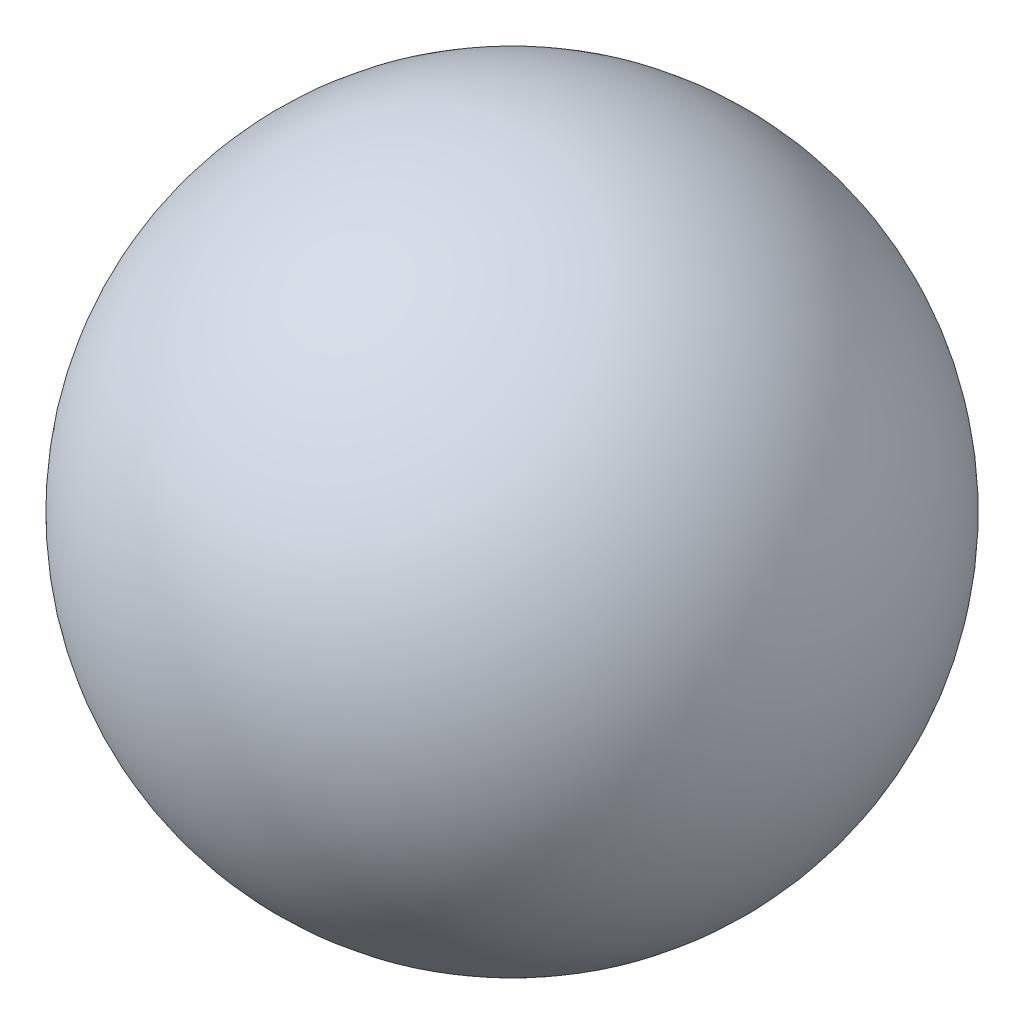
ISO-10303-21;
HEADER;
FILE_DESCRIPTION(('STEP AP214'),'2;1');
FILE_NAME('part.step','',(''),(''),'','','');
FILE_SCHEMA(('AUTOMOTIVE_DESIGN { 1 0 10303 214 1 1 1 1 }'));
ENDSEC;
DATA;
#1=APPLICATION_CONTEXT('core data for automotive mechanical design processes');
#2=APPLICATION_PROTOCOL_DEFINITION('international standard','automotive_design',2000,#1);
#3=PRODUCT_CONTEXT('',#1,'mechanical');
#4=PRODUCT('Part','Part','',(#3));
#5=PRODUCT_RELATED_PRODUCT_CATEGORY('part','',(#4));
#6=PRODUCT_DEFINITION_FORMATION('','',#4);
#7=PRODUCT_DEFINITION_CONTEXT('part definition',#1,'design');
#8=PRODUCT_DEFINITION('design','',#6,#7);
#9=PRODUCT_DEFINITION_SHAPE('','',#8);
#10=(LENGTH_UNIT() NAMED_UNIT(*) SI_UNIT(.MILLI.,.METRE.));
#11=(NAMED_UNIT(*) PLANE_ANGLE_UNIT() SI_UNIT($,.RADIAN.));
#12=(NAMED_UNIT(*) SI_UNIT($,.STERADIAN.) SOLID_ANGLE_UNIT());
#13=UNCERTAINTY_MEASURE_WITH_UNIT(LENGTH_MEASURE(1.E-05),#10,'distance_accuracy_value','');
#14=(GEOMETRIC_REPRESENTATION_CONTEXT(3) GLOBAL_UNCERTAINTY_ASSIGNED_CONTEXT((#13)) GLOBAL_UNIT_ASSIGNED_CONTEXT((#10,
#11,#12)) REPRESENTATION_CONTEXT('',''));
#15=CARTESIAN_POINT('',(0.,0.,0.));
#16=DIRECTION('',(0.,0.,1.));
#17=DIRECTION('',(1.,0.,0.));
#18=AXIS2_PLACEMENT_3D('',#15,#16,#17);
#19=CARTESIAN_POINT('',(0.,0.,0.));
#20=DIRECTION('',(0.,1.,0.));
#21=DIRECTION('',(1.,0.,0.));
#22=AXIS2_PLACEMENT_3D('',#19,#20,#21);
#23=SPHERICAL_SURFACE('',#22,4.);
#24=CARTESIAN_POINT('',(0.,4.,0.));
#25=VERTEX_POINT('',#24);
#26=VERTEX_LOOP('',#25);
#27=FACE_BOUND('',#26,.T.);
#28=ADVANCED_FACE('F31',(#27),#23,.T.);
#29=CLOSED_SHELL('',(#28));
#30=MANIFOLD_SOLID_BREP('B2',#29);
#31=ADVANCED_BREP_SHAPE_REPRESENTATION('',(#18,#30),#14);
#32=SHAPE_DEFINITION_REPRESENTATION(#9,#31);
ENDSEC;
END-ISO-10303-21;
